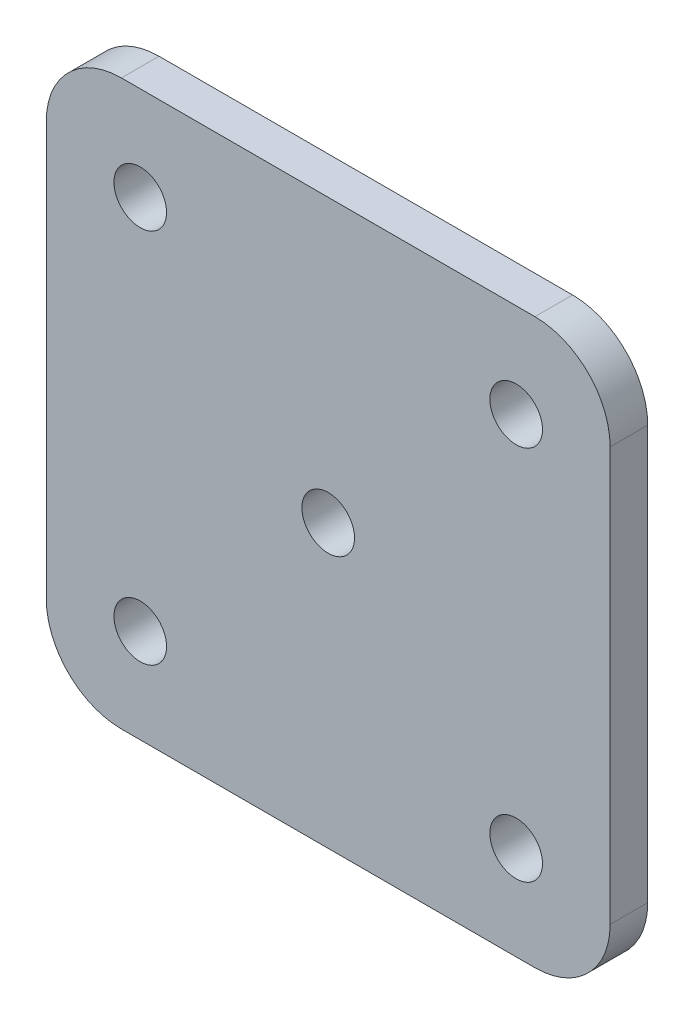
ISO-10303-21;
HEADER;
FILE_DESCRIPTION(('STEP AP214'),'2;1');
FILE_NAME('part.step','',(''),(''),'','','');
FILE_SCHEMA(('AUTOMOTIVE_DESIGN { 1 0 10303 214 1 1 1 1 }'));
ENDSEC;
DATA;
#1=APPLICATION_CONTEXT('core data for automotive mechanical design processes');
#2=APPLICATION_PROTOCOL_DEFINITION('international standard','automotive_design',2000,#1);
#3=PRODUCT_CONTEXT('',#1,'mechanical');
#4=PRODUCT('Part','Part','',(#3));
#5=PRODUCT_RELATED_PRODUCT_CATEGORY('part','',(#4));
#6=PRODUCT_DEFINITION_FORMATION('','',#4);
#7=PRODUCT_DEFINITION_CONTEXT('part definition',#1,'design');
#8=PRODUCT_DEFINITION('design','',#6,#7);
#9=PRODUCT_DEFINITION_SHAPE('','',#8);
#10=(LENGTH_UNIT() NAMED_UNIT(*) SI_UNIT(.MILLI.,.METRE.));
#11=(NAMED_UNIT(*) PLANE_ANGLE_UNIT() SI_UNIT($,.RADIAN.));
#12=(NAMED_UNIT(*) SI_UNIT($,.STERADIAN.) SOLID_ANGLE_UNIT());
#13=UNCERTAINTY_MEASURE_WITH_UNIT(LENGTH_MEASURE(1.E-05),#10,'distance_accuracy_value','');
#14=(GEOMETRIC_REPRESENTATION_CONTEXT(3) GLOBAL_UNCERTAINTY_ASSIGNED_CONTEXT((#13)) GLOBAL_UNIT_ASSIGNED_CONTEXT((#10,
#11,#12)) REPRESENTATION_CONTEXT('',''));
#15=CARTESIAN_POINT('',(0.,0.,0.));
#16=DIRECTION('',(0.,0.,1.));
#17=DIRECTION('',(1.,0.,0.));
#18=AXIS2_PLACEMENT_3D('',#15,#16,#17);
#19=CARTESIAN_POINT('',(-37.5,37.5,5.));
#20=DIRECTION('',(1.,0.,0.));
#21=DIRECTION('',(0.,1.,0.));
#22=AXIS2_PLACEMENT_3D('',#19,#20,#21);
#23=PLANE('',#22);
#24=DIRECTION('',(0.,-1.,0.));
#25=VECTOR('',#24,1.);
#26=CARTESIAN_POINT('',(-37.5,37.5,5.));
#27=LINE('',#26,#25);
#28=CARTESIAN_POINT('',(-37.5,27.5,5.));
#29=VERTEX_POINT('',#28);
#30=CARTESIAN_POINT('',(-37.5,-27.5,5.));
#31=VERTEX_POINT('',#30);
#32=EDGE_CURVE('E121',#29,#31,#27,.T.);
#33=ORIENTED_EDGE('',*,*,#32,.F.);
#34=DIRECTION('',(0.,0.,-1.));
#35=VECTOR('',#34,1.);
#36=CARTESIAN_POINT('',(-37.5,27.5,5.));
#37=LINE('',#36,#35);
#38=CARTESIAN_POINT('',(-37.5,27.5,0.));
#39=VERTEX_POINT('',#38);
#40=EDGE_CURVE('E106',#29,#39,#37,.T.);
#41=ORIENTED_EDGE('',*,*,#40,.T.);
#42=DIRECTION('',(0.,-1.,0.));
#43=VECTOR('',#42,1.);
#44=CARTESIAN_POINT('',(-37.5,37.5,0.));
#45=LINE('',#44,#43);
#46=CARTESIAN_POINT('',(-37.5,-27.5,0.));
#47=VERTEX_POINT('',#46);
#48=EDGE_CURVE('E118',#39,#47,#45,.T.);
#49=ORIENTED_EDGE('',*,*,#48,.T.);
#50=DIRECTION('',(0.,0.,-1.));
#51=VECTOR('',#50,1.);
#52=CARTESIAN_POINT('',(-37.5,-27.5,5.));
#53=LINE('',#52,#51);
#54=EDGE_CURVE('E123',#47,#31,#53,.F.);
#55=ORIENTED_EDGE('',*,*,#54,.T.);
#56=EDGE_LOOP('',(#33,#41,#49,#55));
#57=FACE_BOUND('',#56,.T.);
#58=ADVANCED_FACE('F36',(#57),#23,.F.);
#59=CARTESIAN_POINT('',(-37.5,-37.5,5.));
#60=DIRECTION('',(0.,1.,0.));
#61=DIRECTION('',(-1.,0.,0.));
#62=AXIS2_PLACEMENT_3D('',#59,#60,#61);
#63=PLANE('',#62);
#64=DIRECTION('',(1.,0.,0.));
#65=VECTOR('',#64,1.);
#66=CARTESIAN_POINT('',(-37.5,-37.5,5.));
#67=LINE('',#66,#65);
#68=CARTESIAN_POINT('',(-27.5,-37.5,5.));
#69=VERTEX_POINT('',#68);
#70=CARTESIAN_POINT('',(27.5,-37.5,5.));
#71=VERTEX_POINT('',#70);
#72=EDGE_CURVE('E167',#69,#71,#67,.T.);
#73=ORIENTED_EDGE('',*,*,#72,.F.);
#74=DIRECTION('',(0.,0.,-1.));
#75=VECTOR('',#74,1.);
#76=CARTESIAN_POINT('',(-27.5,-37.5,5.));
#77=LINE('',#76,#75);
#78=CARTESIAN_POINT('',(-27.5,-37.5,0.));
#79=VERTEX_POINT('',#78);
#80=EDGE_CURVE('E160',#69,#79,#77,.T.);
#81=ORIENTED_EDGE('',*,*,#80,.T.);
#82=DIRECTION('',(1.,0.,0.));
#83=VECTOR('',#82,1.);
#84=CARTESIAN_POINT('',(-37.5,-37.5,0.));
#85=LINE('',#84,#83);
#86=CARTESIAN_POINT('',(27.5,-37.5,0.));
#87=VERTEX_POINT('',#86);
#88=EDGE_CURVE('E127',#79,#87,#85,.T.);
#89=ORIENTED_EDGE('',*,*,#88,.T.);
#90=DIRECTION('',(0.,0.,-1.));
#91=VECTOR('',#90,1.);
#92=CARTESIAN_POINT('',(27.5,-37.5,5.));
#93=LINE('',#92,#91);
#94=EDGE_CURVE('E158',#87,#71,#93,.F.);
#95=ORIENTED_EDGE('',*,*,#94,.T.);
#96=EDGE_LOOP('',(#73,#81,#89,#95));
#97=FACE_BOUND('',#96,.T.);
#98=ADVANCED_FACE('F165',(#97),#63,.F.);
#99=CARTESIAN_POINT('',(37.5,37.5,5.));
#100=DIRECTION('',(-1.,0.,0.));
#101=DIRECTION('',(0.,0.,1.));
#102=AXIS2_PLACEMENT_3D('',#99,#100,#101);
#103=PLANE('',#102);
#104=DIRECTION('',(0.,1.,0.));
#105=VECTOR('',#104,1.);
#106=CARTESIAN_POINT('',(37.5,37.5,5.));
#107=LINE('',#106,#105);
#108=CARTESIAN_POINT('',(37.5,-27.5,5.));
#109=VERTEX_POINT('',#108);
#110=CARTESIAN_POINT('',(37.5,27.5,5.));
#111=VERTEX_POINT('',#110);
#112=EDGE_CURVE('E175',#109,#111,#107,.T.);
#113=ORIENTED_EDGE('',*,*,#112,.F.);
#114=DIRECTION('',(0.,0.,-1.));
#115=VECTOR('',#114,1.);
#116=CARTESIAN_POINT('',(37.5,-27.5,5.));
#117=LINE('',#116,#115);
#118=CARTESIAN_POINT('',(37.5,-27.5,0.));
#119=VERTEX_POINT('',#118);
#120=EDGE_CURVE('E11',#109,#119,#117,.T.);
#121=ORIENTED_EDGE('',*,*,#120,.T.);
#122=DIRECTION('',(0.,1.,0.));
#123=VECTOR('',#122,1.);
#124=CARTESIAN_POINT('',(37.5,37.5,0.));
#125=LINE('',#124,#123);
#126=CARTESIAN_POINT('',(37.5,27.5,0.));
#127=VERTEX_POINT('',#126);
#128=EDGE_CURVE('E131',#119,#127,#125,.T.);
#129=ORIENTED_EDGE('',*,*,#128,.T.);
#130=DIRECTION('',(0.,0.,-1.));
#131=VECTOR('',#130,1.);
#132=CARTESIAN_POINT('',(37.5,27.5,5.));
#133=LINE('',#132,#131);
#134=EDGE_CURVE('E44',#127,#111,#133,.F.);
#135=ORIENTED_EDGE('',*,*,#134,.T.);
#136=EDGE_LOOP('',(#113,#121,#129,#135));
#137=FACE_BOUND('',#136,.T.);
#138=ADVANCED_FACE('F174',(#137),#103,.F.);
#139=CARTESIAN_POINT('',(-37.5,37.5,5.));
#140=DIRECTION('',(0.,-1.,0.));
#141=DIRECTION('',(1.,0.,0.));
#142=AXIS2_PLACEMENT_3D('',#139,#140,#141);
#143=PLANE('',#142);
#144=DIRECTION('',(-1.,0.,0.));
#145=VECTOR('',#144,1.);
#146=CARTESIAN_POINT('',(-37.5,37.5,0.));
#147=LINE('',#146,#145);
#148=CARTESIAN_POINT('',(27.5,37.5,0.));
#149=VERTEX_POINT('',#148);
#150=CARTESIAN_POINT('',(-27.5,37.5,0.));
#151=VERTEX_POINT('',#150);
#152=EDGE_CURVE('E141',#149,#151,#147,.T.);
#153=ORIENTED_EDGE('',*,*,#152,.T.);
#154=DIRECTION('',(0.,0.,-1.));
#155=VECTOR('',#154,1.);
#156=CARTESIAN_POINT('',(-27.5,37.5,5.));
#157=LINE('',#156,#155);
#158=CARTESIAN_POINT('',(-27.5,37.5,5.));
#159=VERTEX_POINT('',#158);
#160=EDGE_CURVE('E107',#151,#159,#157,.F.);
#161=ORIENTED_EDGE('',*,*,#160,.T.);
#162=DIRECTION('',(-1.,0.,0.));
#163=VECTOR('',#162,1.);
#164=CARTESIAN_POINT('',(-37.5,37.5,5.));
#165=LINE('',#164,#163);
#166=CARTESIAN_POINT('',(27.5,37.5,5.));
#167=VERTEX_POINT('',#166);
#168=EDGE_CURVE('E137',#167,#159,#165,.T.);
#169=ORIENTED_EDGE('',*,*,#168,.F.);
#170=DIRECTION('',(0.,0.,-1.));
#171=VECTOR('',#170,1.);
#172=CARTESIAN_POINT('',(27.5,37.5,5.));
#173=LINE('',#172,#171);
#174=EDGE_CURVE('E112',#167,#149,#173,.T.);
#175=ORIENTED_EDGE('',*,*,#174,.T.);
#176=EDGE_LOOP('',(#153,#161,#169,#175));
#177=FACE_BOUND('',#176,.T.);
#178=ADVANCED_FACE('F213',(#177),#143,.F.);
#179=CARTESIAN_POINT('',(0.,0.,5.));
#180=DIRECTION('',(0.,0.,1.));
#181=DIRECTION('',(1.,0.,0.));
#182=AXIS2_PLACEMENT_3D('',#179,#180,#181);
#183=PLANE('',#182);
#184=CARTESIAN_POINT('',(0.,0.,5.));
#185=DIRECTION('',(0.,0.,1.));
#186=DIRECTION('',(1.,0.,0.));
#187=AXIS2_PLACEMENT_3D('',#184,#185,#186);
#188=CIRCLE('',#187,3.5);
#189=CARTESIAN_POINT('',(3.5,0.,5.));
#190=VERTEX_POINT('',#189);
#191=EDGE_CURVE('E204',#190,#190,#188,.T.);
#192=ORIENTED_EDGE('',*,*,#191,.F.);
#193=EDGE_LOOP('',(#192));
#194=FACE_BOUND('',#193,.T.);
#195=CARTESIAN_POINT('',(-25.,25.,5.));
#196=DIRECTION('',(0.,0.,1.));
#197=DIRECTION('',(1.,0.,0.));
#198=AXIS2_PLACEMENT_3D('',#195,#196,#197);
#199=CIRCLE('',#198,3.5);
#200=CARTESIAN_POINT('',(-21.5,25.,5.));
#201=VERTEX_POINT('',#200);
#202=EDGE_CURVE('E198',#201,#201,#199,.T.);
#203=ORIENTED_EDGE('',*,*,#202,.F.);
#204=EDGE_LOOP('',(#203));
#205=FACE_BOUND('',#204,.T.);
#206=CARTESIAN_POINT('',(-25.,-25.,5.));
#207=DIRECTION('',(0.,0.,1.));
#208=DIRECTION('',(1.,0.,0.));
#209=AXIS2_PLACEMENT_3D('',#206,#207,#208);
#210=CIRCLE('',#209,3.5);
#211=CARTESIAN_POINT('',(-21.5,-25.,5.));
#212=VERTEX_POINT('',#211);
#213=EDGE_CURVE('E192',#212,#212,#210,.T.);
#214=ORIENTED_EDGE('',*,*,#213,.F.);
#215=EDGE_LOOP('',(#214));
#216=FACE_BOUND('',#215,.T.);
#217=CARTESIAN_POINT('',(25.,-25.,5.));
#218=DIRECTION('',(0.,0.,1.));
#219=DIRECTION('',(1.,0.,0.));
#220=AXIS2_PLACEMENT_3D('',#217,#218,#219);
#221=CIRCLE('',#220,3.5);
#222=CARTESIAN_POINT('',(28.5,-25.,5.));
#223=VERTEX_POINT('',#222);
#224=EDGE_CURVE('E186',#223,#223,#221,.T.);
#225=ORIENTED_EDGE('',*,*,#224,.F.);
#226=EDGE_LOOP('',(#225));
#227=FACE_BOUND('',#226,.T.);
#228=CARTESIAN_POINT('',(25.,25.,5.));
#229=DIRECTION('',(0.,0.,1.));
#230=DIRECTION('',(1.,0.,0.));
#231=AXIS2_PLACEMENT_3D('',#228,#229,#230);
#232=CIRCLE('',#231,3.5);
#233=CARTESIAN_POINT('',(28.5,25.,5.));
#234=VERTEX_POINT('',#233);
#235=EDGE_CURVE('E134',#234,#234,#232,.T.);
#236=ORIENTED_EDGE('',*,*,#235,.F.);
#237=EDGE_LOOP('',(#236));
#238=FACE_BOUND('',#237,.T.);
#239=ORIENTED_EDGE('',*,*,#168,.T.);
#240=CARTESIAN_POINT('',(-27.5,27.5,5.));
#241=DIRECTION('',(0.,0.,1.));
#242=DIRECTION('',(1.,0.,0.));
#243=AXIS2_PLACEMENT_3D('',#240,#241,#242);
#244=CIRCLE('',#243,10.);
#245=EDGE_CURVE('E156',#159,#29,#244,.T.);
#246=ORIENTED_EDGE('',*,*,#245,.T.);
#247=ORIENTED_EDGE('',*,*,#32,.T.);
#248=CARTESIAN_POINT('',(-27.5,-27.5,5.));
#249=DIRECTION('',(0.,0.,1.));
#250=DIRECTION('',(1.,0.,0.));
#251=AXIS2_PLACEMENT_3D('',#248,#249,#250);
#252=CIRCLE('',#251,10.);
#253=EDGE_CURVE('E154',#31,#69,#252,.T.);
#254=ORIENTED_EDGE('',*,*,#253,.T.);
#255=ORIENTED_EDGE('',*,*,#72,.T.);
#256=CARTESIAN_POINT('',(27.5,-27.5,5.));
#257=DIRECTION('',(0.,0.,1.));
#258=DIRECTION('',(1.,0.,0.));
#259=AXIS2_PLACEMENT_3D('',#256,#257,#258);
#260=CIRCLE('',#259,10.);
#261=EDGE_CURVE('E57',#71,#109,#260,.T.);
#262=ORIENTED_EDGE('',*,*,#261,.T.);
#263=ORIENTED_EDGE('',*,*,#112,.T.);
#264=CARTESIAN_POINT('',(27.5,27.5,5.));
#265=DIRECTION('',(0.,0.,1.));
#266=DIRECTION('',(1.,0.,0.));
#267=AXIS2_PLACEMENT_3D('',#264,#265,#266);
#268=CIRCLE('',#267,10.);
#269=EDGE_CURVE('E151',#111,#167,#268,.T.);
#270=ORIENTED_EDGE('',*,*,#269,.T.);
#271=EDGE_LOOP('',(#239,#246,#247,#254,#255,#262,#263,#270));
#272=FACE_BOUND('',#271,.T.);
#273=ADVANCED_FACE('F210',(#194,#205,#216,#227,#238,#272),#183,.T.);
#274=CARTESIAN_POINT('',(0.,0.,0.));
#275=DIRECTION('',(0.,0.,1.));
#276=DIRECTION('',(1.,0.,0.));
#277=AXIS2_PLACEMENT_3D('',#274,#275,#276);
#278=PLANE('',#277);
#279=CARTESIAN_POINT('',(0.,0.,0.));
#280=DIRECTION('',(0.,0.,1.));
#281=DIRECTION('',(1.,0.,0.));
#282=AXIS2_PLACEMENT_3D('',#279,#280,#281);
#283=CIRCLE('',#282,3.5);
#284=CARTESIAN_POINT('',(3.5,0.,0.));
#285=VERTEX_POINT('',#284);
#286=EDGE_CURVE('E201',#285,#285,#283,.T.);
#287=ORIENTED_EDGE('',*,*,#286,.T.);
#288=EDGE_LOOP('',(#287));
#289=FACE_BOUND('',#288,.T.);
#290=CARTESIAN_POINT('',(-25.,25.,0.));
#291=DIRECTION('',(0.,0.,1.));
#292=DIRECTION('',(1.,0.,0.));
#293=AXIS2_PLACEMENT_3D('',#290,#291,#292);
#294=CIRCLE('',#293,3.5);
#295=CARTESIAN_POINT('',(-21.5,25.,0.));
#296=VERTEX_POINT('',#295);
#297=EDGE_CURVE('E195',#296,#296,#294,.T.);
#298=ORIENTED_EDGE('',*,*,#297,.T.);
#299=EDGE_LOOP('',(#298));
#300=FACE_BOUND('',#299,.T.);
#301=CARTESIAN_POINT('',(-25.,-25.,0.));
#302=DIRECTION('',(0.,0.,1.));
#303=DIRECTION('',(1.,0.,0.));
#304=AXIS2_PLACEMENT_3D('',#301,#302,#303);
#305=CIRCLE('',#304,3.5);
#306=CARTESIAN_POINT('',(-21.5,-25.,0.));
#307=VERTEX_POINT('',#306);
#308=EDGE_CURVE('E189',#307,#307,#305,.T.);
#309=ORIENTED_EDGE('',*,*,#308,.T.);
#310=EDGE_LOOP('',(#309));
#311=FACE_BOUND('',#310,.T.);
#312=CARTESIAN_POINT('',(25.,-25.,0.));
#313=DIRECTION('',(0.,0.,1.));
#314=DIRECTION('',(1.,0.,0.));
#315=AXIS2_PLACEMENT_3D('',#312,#313,#314);
#316=CIRCLE('',#315,3.5);
#317=CARTESIAN_POINT('',(28.5,-25.,0.));
#318=VERTEX_POINT('',#317);
#319=EDGE_CURVE('E183',#318,#318,#316,.T.);
#320=ORIENTED_EDGE('',*,*,#319,.T.);
#321=EDGE_LOOP('',(#320));
#322=FACE_BOUND('',#321,.T.);
#323=CARTESIAN_POINT('',(25.,25.,0.));
#324=DIRECTION('',(0.,0.,1.));
#325=DIRECTION('',(1.,0.,0.));
#326=AXIS2_PLACEMENT_3D('',#323,#324,#325);
#327=CIRCLE('',#326,3.5);
#328=CARTESIAN_POINT('',(28.5,25.,0.));
#329=VERTEX_POINT('',#328);
#330=EDGE_CURVE('E128',#329,#329,#327,.T.);
#331=ORIENTED_EDGE('',*,*,#330,.T.);
#332=EDGE_LOOP('',(#331));
#333=FACE_BOUND('',#332,.T.);
#334=ORIENTED_EDGE('',*,*,#48,.F.);
#335=CARTESIAN_POINT('',(-27.5,27.5,0.));
#336=DIRECTION('',(0.,0.,1.));
#337=DIRECTION('',(1.,0.,0.));
#338=AXIS2_PLACEMENT_3D('',#335,#336,#337);
#339=CIRCLE('',#338,10.);
#340=EDGE_CURVE('E102',#39,#151,#339,.F.);
#341=ORIENTED_EDGE('',*,*,#340,.T.);
#342=ORIENTED_EDGE('',*,*,#152,.F.);
#343=CARTESIAN_POINT('',(27.5,27.5,0.));
#344=DIRECTION('',(0.,0.,1.));
#345=DIRECTION('',(1.,0.,0.));
#346=AXIS2_PLACEMENT_3D('',#343,#344,#345);
#347=CIRCLE('',#346,10.);
#348=EDGE_CURVE('E122',#149,#127,#347,.F.);
#349=ORIENTED_EDGE('',*,*,#348,.T.);
#350=ORIENTED_EDGE('',*,*,#128,.F.);
#351=CARTESIAN_POINT('',(27.5,-27.5,0.));
#352=DIRECTION('',(0.,0.,1.));
#353=DIRECTION('',(1.,0.,0.));
#354=AXIS2_PLACEMENT_3D('',#351,#352,#353);
#355=CIRCLE('',#354,10.);
#356=EDGE_CURVE('E145',#119,#87,#355,.F.);
#357=ORIENTED_EDGE('',*,*,#356,.T.);
#358=ORIENTED_EDGE('',*,*,#88,.F.);
#359=CARTESIAN_POINT('',(-27.5,-27.5,0.));
#360=DIRECTION('',(0.,0.,1.));
#361=DIRECTION('',(1.,0.,0.));
#362=AXIS2_PLACEMENT_3D('',#359,#360,#361);
#363=CIRCLE('',#362,10.);
#364=EDGE_CURVE('E113',#79,#47,#363,.F.);
#365=ORIENTED_EDGE('',*,*,#364,.T.);
#366=EDGE_LOOP('',(#334,#341,#342,#349,#350,#357,#358,#365));
#367=FACE_BOUND('',#366,.T.);
#368=ADVANCED_FACE('F125',(#289,#300,#311,#322,#333,#367),#278,.F.);
#369=CARTESIAN_POINT('',(25.,25.,5.));
#370=DIRECTION('',(0.,0.,1.));
#371=DIRECTION('',(1.,0.,0.));
#372=AXIS2_PLACEMENT_3D('',#369,#370,#371);
#373=CYLINDRICAL_SURFACE('',#372,3.5);
#374=ORIENTED_EDGE('',*,*,#330,.F.);
#375=EDGE_LOOP('',(#374));
#376=FACE_BOUND('',#375,.T.);
#377=ORIENTED_EDGE('',*,*,#235,.T.);
#378=EDGE_LOOP('',(#377));
#379=FACE_BOUND('',#378,.T.);
#380=ADVANCED_FACE('F277',(#376,#379),#373,.F.);
#381=CARTESIAN_POINT('',(25.,-25.,5.));
#382=DIRECTION('',(0.,0.,1.));
#383=DIRECTION('',(1.,0.,0.));
#384=AXIS2_PLACEMENT_3D('',#381,#382,#383);
#385=CYLINDRICAL_SURFACE('',#384,3.5);
#386=ORIENTED_EDGE('',*,*,#319,.F.);
#387=EDGE_LOOP('',(#386));
#388=FACE_BOUND('',#387,.T.);
#389=ORIENTED_EDGE('',*,*,#224,.T.);
#390=EDGE_LOOP('',(#389));
#391=FACE_BOUND('',#390,.T.);
#392=ADVANCED_FACE('F292',(#388,#391),#385,.F.);
#393=CARTESIAN_POINT('',(-25.,-25.,5.));
#394=DIRECTION('',(0.,0.,1.));
#395=DIRECTION('',(1.,0.,0.));
#396=AXIS2_PLACEMENT_3D('',#393,#394,#395);
#397=CYLINDRICAL_SURFACE('',#396,3.5);
#398=ORIENTED_EDGE('',*,*,#308,.F.);
#399=EDGE_LOOP('',(#398));
#400=FACE_BOUND('',#399,.T.);
#401=ORIENTED_EDGE('',*,*,#213,.T.);
#402=EDGE_LOOP('',(#401));
#403=FACE_BOUND('',#402,.T.);
#404=ADVANCED_FACE('F299',(#400,#403),#397,.F.);
#405=CARTESIAN_POINT('',(-25.,25.,5.));
#406=DIRECTION('',(0.,0.,1.));
#407=DIRECTION('',(1.,0.,0.));
#408=AXIS2_PLACEMENT_3D('',#405,#406,#407);
#409=CYLINDRICAL_SURFACE('',#408,3.5);
#410=ORIENTED_EDGE('',*,*,#297,.F.);
#411=EDGE_LOOP('',(#410));
#412=FACE_BOUND('',#411,.T.);
#413=ORIENTED_EDGE('',*,*,#202,.T.);
#414=EDGE_LOOP('',(#413));
#415=FACE_BOUND('',#414,.T.);
#416=ADVANCED_FACE('F244',(#412,#415),#409,.F.);
#417=CARTESIAN_POINT('',(-27.5,27.5,5.));
#418=DIRECTION('',(0.,0.,-1.));
#419=DIRECTION('',(-1.,0.,0.));
#420=AXIS2_PLACEMENT_3D('',#417,#418,#419);
#421=CYLINDRICAL_SURFACE('',#420,10.);
#422=ORIENTED_EDGE('',*,*,#245,.F.);
#423=ORIENTED_EDGE('',*,*,#160,.F.);
#424=ORIENTED_EDGE('',*,*,#340,.F.);
#425=ORIENTED_EDGE('',*,*,#40,.F.);
#426=EDGE_LOOP('',(#422,#423,#424,#425));
#427=FACE_BOUND('',#426,.T.);
#428=ADVANCED_FACE('F105',(#427),#421,.T.);
#429=CARTESIAN_POINT('',(-27.5,-27.5,5.));
#430=DIRECTION('',(0.,0.,-1.));
#431=DIRECTION('',(-1.,0.,0.));
#432=AXIS2_PLACEMENT_3D('',#429,#430,#431);
#433=CYLINDRICAL_SURFACE('',#432,10.);
#434=ORIENTED_EDGE('',*,*,#253,.F.);
#435=ORIENTED_EDGE('',*,*,#54,.F.);
#436=ORIENTED_EDGE('',*,*,#364,.F.);
#437=ORIENTED_EDGE('',*,*,#80,.F.);
#438=EDGE_LOOP('',(#434,#435,#436,#437));
#439=FACE_BOUND('',#438,.T.);
#440=ADVANCED_FACE('F233',(#439),#433,.T.);
#441=CARTESIAN_POINT('',(27.5,-27.5,5.));
#442=DIRECTION('',(0.,0.,-1.));
#443=DIRECTION('',(-1.,0.,0.));
#444=AXIS2_PLACEMENT_3D('',#441,#442,#443);
#445=CYLINDRICAL_SURFACE('',#444,10.);
#446=ORIENTED_EDGE('',*,*,#261,.F.);
#447=ORIENTED_EDGE('',*,*,#94,.F.);
#448=ORIENTED_EDGE('',*,*,#356,.F.);
#449=ORIENTED_EDGE('',*,*,#120,.F.);
#450=EDGE_LOOP('',(#446,#447,#448,#449));
#451=FACE_BOUND('',#450,.T.);
#452=ADVANCED_FACE('F173',(#451),#445,.T.);
#453=CARTESIAN_POINT('',(27.5,27.5,5.));
#454=DIRECTION('',(0.,0.,-1.));
#455=DIRECTION('',(-1.,0.,0.));
#456=AXIS2_PLACEMENT_3D('',#453,#454,#455);
#457=CYLINDRICAL_SURFACE('',#456,10.);
#458=ORIENTED_EDGE('',*,*,#269,.F.);
#459=ORIENTED_EDGE('',*,*,#134,.F.);
#460=ORIENTED_EDGE('',*,*,#348,.F.);
#461=ORIENTED_EDGE('',*,*,#174,.F.);
#462=EDGE_LOOP('',(#458,#459,#460,#461));
#463=FACE_BOUND('',#462,.T.);
#464=ADVANCED_FACE('F38',(#463),#457,.T.);
#465=CARTESIAN_POINT('',(0.,0.,5.));
#466=DIRECTION('',(0.,0.,1.));
#467=DIRECTION('',(1.,0.,0.));
#468=AXIS2_PLACEMENT_3D('',#465,#466,#467);
#469=CYLINDRICAL_SURFACE('',#468,3.5);
#470=ORIENTED_EDGE('',*,*,#286,.F.);
#471=EDGE_LOOP('',(#470));
#472=FACE_BOUND('',#471,.T.);
#473=ORIENTED_EDGE('',*,*,#191,.T.);
#474=EDGE_LOOP('',(#473));
#475=FACE_BOUND('',#474,.T.);
#476=ADVANCED_FACE('F208',(#472,#475),#469,.F.);
#477=CLOSED_SHELL('',(#58,#98,#138,#178,#273,#368,#380,#392,#404,#416,#428,#440,#452,#464,#476));
#478=MANIFOLD_SOLID_BREP('B2',#477);
#479=ADVANCED_BREP_SHAPE_REPRESENTATION('',(#18,#478),#14);
#480=SHAPE_DEFINITION_REPRESENTATION(#9,#479);
ENDSEC;
END-ISO-10303-21;
